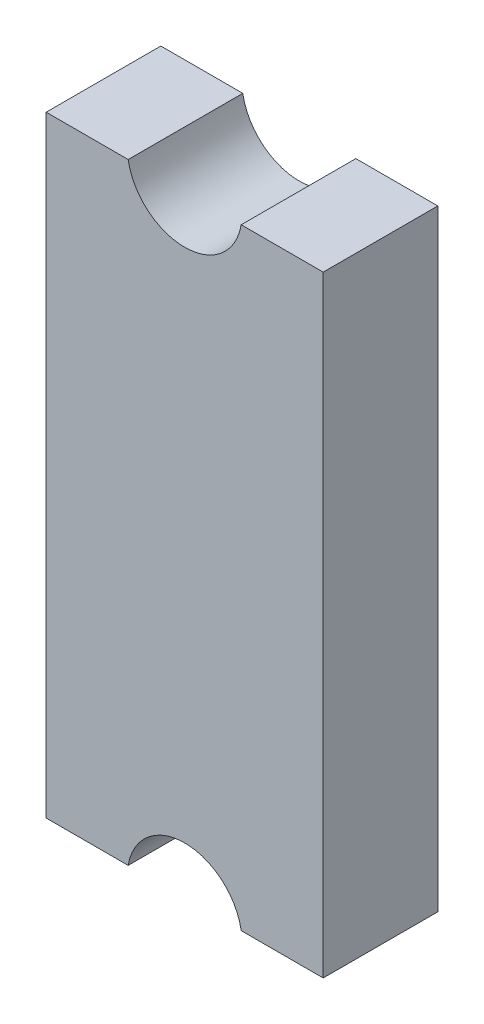
ISO-10303-21;
HEADER;
FILE_DESCRIPTION(('STEP AP214'),'2;1');
FILE_NAME('part.step','',(''),(''),'','','');
FILE_SCHEMA(('AUTOMOTIVE_DESIGN { 1 0 10303 214 1 1 1 1 }'));
ENDSEC;
DATA;
#1=APPLICATION_CONTEXT('core data for automotive mechanical design processes');
#2=APPLICATION_PROTOCOL_DEFINITION('international standard','automotive_design',2000,#1);
#3=PRODUCT_CONTEXT('',#1,'mechanical');
#4=PRODUCT('Part','Part','',(#3));
#5=PRODUCT_RELATED_PRODUCT_CATEGORY('part','',(#4));
#6=PRODUCT_DEFINITION_FORMATION('','',#4);
#7=PRODUCT_DEFINITION_CONTEXT('part definition',#1,'design');
#8=PRODUCT_DEFINITION('design','',#6,#7);
#9=PRODUCT_DEFINITION_SHAPE('','',#8);
#10=(LENGTH_UNIT() NAMED_UNIT(*) SI_UNIT(.MILLI.,.METRE.));
#11=(NAMED_UNIT(*) PLANE_ANGLE_UNIT() SI_UNIT($,.RADIAN.));
#12=(NAMED_UNIT(*) SI_UNIT($,.STERADIAN.) SOLID_ANGLE_UNIT());
#13=UNCERTAINTY_MEASURE_WITH_UNIT(LENGTH_MEASURE(1.E-05),#10,'distance_accuracy_value','');
#14=(GEOMETRIC_REPRESENTATION_CONTEXT(3) GLOBAL_UNCERTAINTY_ASSIGNED_CONTEXT((#13)) GLOBAL_UNIT_ASSIGNED_CONTEXT((#10,
#11,#12)) REPRESENTATION_CONTEXT('',''));
#15=CARTESIAN_POINT('',(0.,0.,0.));
#16=DIRECTION('',(0.,0.,1.));
#17=DIRECTION('',(1.,0.,0.));
#18=AXIS2_PLACEMENT_3D('',#15,#16,#17);
#19=CARTESIAN_POINT('',(-0.00534350019981917,-0.617441590055831,0.0297664210005663));
#20=DIRECTION('',(0.,0.,1.));
#21=DIRECTION('',(1.,0.,0.));
#22=AXIS2_PLACEMENT_3D('',#19,#20,#21);
#23=PLANE('',#22);
#24=CARTESIAN_POINT('',(-0.00534350019990265,0.207558409944186,0.0297664210005663));
#25=DIRECTION('',(0.,0.,1.));
#26=DIRECTION('',(-1.,0.,0.));
#27=AXIS2_PLACEMENT_3D('',#24,#25,#26);
#28=CIRCLE('',#27,0.150000000000034);
#29=CARTESIAN_POINT('',(-0.153245494777424,0.182558409944165,0.0297664210005663));
#30=VERTEX_POINT('',#29);
#31=CARTESIAN_POINT('',(0.142558494377624,0.182558409944195,0.0297664210005663));
#32=VERTEX_POINT('',#31);
#33=EDGE_CURVE('E11',#30,#32,#28,.T.);
#34=ORIENTED_EDGE('',*,*,#33,.T.);
#35=DIRECTION('',(-1.,-1.01196828694583E-13,0.));
#36=VECTOR('',#35,1.);
#37=CARTESIAN_POINT('',(0.357156499800111,0.182558409944217,0.0297664210005664));
#38=LINE('',#37,#36);
#39=CARTESIAN_POINT('',(0.357156499800111,0.182558409944217,0.0297664210005664));
#40=VERTEX_POINT('',#39);
#41=EDGE_CURVE('E24',#40,#32,#38,.T.);
#42=ORIENTED_EDGE('',*,*,#41,.F.);
#43=DIRECTION('',(-1.01196828694583E-13,1.,0.));
#44=VECTOR('',#43,1.);
#45=CARTESIAN_POINT('',(0.357156499800273,-1.41744159005578,0.0297664210005664));
#46=LINE('',#45,#44);
#47=CARTESIAN_POINT('',(0.357156499800273,-1.41744159005575,0.0297664210005663));
#48=VERTEX_POINT('',#47);
#49=EDGE_CURVE('E145',#48,#40,#46,.T.);
#50=ORIENTED_EDGE('',*,*,#49,.F.);
#51=DIRECTION('',(1.,1.01196828694583E-13,0.));
#52=VECTOR('',#51,1.);
#53=CARTESIAN_POINT('',(0.357156499800273,-1.41744159005575,0.0297664210005663));
#54=LINE('',#53,#52);
#55=CARTESIAN_POINT('',(0.142558494377786,-1.41744159005577,0.0297664210005663));
#56=VERTEX_POINT('',#55);
#57=EDGE_CURVE('E142',#56,#48,#54,.T.);
#58=ORIENTED_EDGE('',*,*,#57,.F.);
#59=CARTESIAN_POINT('',(-0.00534350019973568,-1.44244159005579,0.0297664210005663));
#60=DIRECTION('',(0.,0.,1.));
#61=DIRECTION('',(1.,0.,0.));
#62=AXIS2_PLACEMENT_3D('',#59,#60,#61);
#63=CIRCLE('',#62,0.150000000000034);
#64=CARTESIAN_POINT('',(-0.153245494777264,-1.41744159005581,0.0297664210005663));
#65=VERTEX_POINT('',#64);
#66=EDGE_CURVE('E140',#56,#65,#63,.T.);
#67=ORIENTED_EDGE('',*,*,#66,.T.);
#68=DIRECTION('',(1.,0.,0.));
#69=VECTOR('',#68,1.);
#70=CARTESIAN_POINT('',(-0.00534350019981917,-1.41744159005582,0.0297664210005663));
#71=LINE('',#70,#69);
#72=CARTESIAN_POINT('',(-0.367843500199804,-1.41744159005582,0.0297664210005663));
#73=VERTEX_POINT('',#72);
#74=EDGE_CURVE('E138',#73,#65,#71,.T.);
#75=ORIENTED_EDGE('',*,*,#74,.F.);
#76=DIRECTION('',(1.01196828694583E-13,-1.,0.));
#77=VECTOR('',#76,1.);
#78=CARTESIAN_POINT('',(-0.367843500199911,0.182558409944144,0.0297664210005664));
#79=LINE('',#78,#77);
#80=CARTESIAN_POINT('',(-0.367843500199911,0.182558409944144,0.0297664210005663));
#81=VERTEX_POINT('',#80);
#82=EDGE_CURVE('E93',#81,#73,#79,.T.);
#83=ORIENTED_EDGE('',*,*,#82,.F.);
#84=DIRECTION('',(-1.,-1.01196828694583E-13,0.));
#85=VECTOR('',#84,1.);
#86=CARTESIAN_POINT('',(0.357156499800111,0.182558409944217,0.0297664210005663));
#87=LINE('',#86,#85);
#88=EDGE_CURVE('E134',#30,#81,#87,.T.);
#89=ORIENTED_EDGE('',*,*,#88,.F.);
#90=EDGE_LOOP('',(#34,#42,#50,#58,#67,#75,#83,#89));
#91=FACE_BOUND('',#90,.T.);
#92=ADVANCED_FACE('F17',(#91),#23,.F.);
#93=CARTESIAN_POINT('',(-0.00534350019973568,-1.44244159005579,-0.221407354482631));
#94=DIRECTION('',(0.,0.,1.));
#95=DIRECTION('',(1.,0.,0.));
#96=AXIS2_PLACEMENT_3D('',#93,#94,#95);
#97=CYLINDRICAL_SURFACE('',#96,0.150000000000034);
#98=ORIENTED_EDGE('',*,*,#66,.F.);
#99=DIRECTION('',(0.,0.,-1.));
#100=VECTOR('',#99,1.);
#101=CARTESIAN_POINT('',(0.142558494377786,-1.41744159005577,0.0297664210005663));
#102=LINE('',#101,#100);
#103=CARTESIAN_POINT('',(0.142558494377786,-1.41744159005577,0.329766421000566));
#104=VERTEX_POINT('',#103);
#105=EDGE_CURVE('E131',#104,#56,#102,.T.);
#106=ORIENTED_EDGE('',*,*,#105,.F.);
#107=CARTESIAN_POINT('',(-0.00534350019973568,-1.44244159005579,0.329766421000566));
#108=DIRECTION('',(0.,0.,-1.));
#109=DIRECTION('',(1.,0.,0.));
#110=AXIS2_PLACEMENT_3D('',#107,#108,#109);
#111=CIRCLE('',#110,0.150000000000034);
#112=CARTESIAN_POINT('',(-0.153245494777264,-1.41744159005581,0.329766421000566));
#113=VERTEX_POINT('',#112);
#114=EDGE_CURVE('E129',#113,#104,#111,.T.);
#115=ORIENTED_EDGE('',*,*,#114,.F.);
#116=DIRECTION('',(0.,0.,1.));
#117=VECTOR('',#116,1.);
#118=CARTESIAN_POINT('',(-0.153245494777262,-1.4174415900558,0.0297664210005663));
#119=LINE('',#118,#117);
#120=EDGE_CURVE('E99',#65,#113,#119,.T.);
#121=ORIENTED_EDGE('',*,*,#120,.F.);
#122=EDGE_LOOP('',(#98,#106,#115,#121));
#123=FACE_BOUND('',#122,.T.);
#124=ADVANCED_FACE('F161',(#123),#97,.F.);
#125=CARTESIAN_POINT('',(0.357156499800273,-1.41744159005575,0.0297664210005663));
#126=DIRECTION('',(1.01196828694583E-13,-1.,0.));
#127=DIRECTION('',(1.,1.01196828694583E-13,0.));
#128=AXIS2_PLACEMENT_3D('',#125,#126,#127);
#129=PLANE('',#128);
#130=ORIENTED_EDGE('',*,*,#105,.T.);
#131=ORIENTED_EDGE('',*,*,#57,.T.);
#132=DIRECTION('',(0.,0.,-1.));
#133=VECTOR('',#132,1.);
#134=CARTESIAN_POINT('',(0.357156499800273,-1.41744159005575,0.0297664210005663));
#135=LINE('',#134,#133);
#136=CARTESIAN_POINT('',(0.357156499800273,-1.41744159005576,0.329766421000566));
#137=VERTEX_POINT('',#136);
#138=EDGE_CURVE('E125',#137,#48,#135,.T.);
#139=ORIENTED_EDGE('',*,*,#138,.F.);
#140=DIRECTION('',(1.,0.,0.));
#141=VECTOR('',#140,1.);
#142=CARTESIAN_POINT('',(-0.00534350019981917,-1.41744159005577,0.329766421000566));
#143=LINE('',#142,#141);
#144=EDGE_CURVE('E122',#104,#137,#143,.T.);
#145=ORIENTED_EDGE('',*,*,#144,.F.);
#146=EDGE_LOOP('',(#130,#131,#139,#145));
#147=FACE_BOUND('',#146,.T.);
#148=ADVANCED_FACE('F158',(#147),#129,.T.);
#149=CARTESIAN_POINT('',(0.357156499800273,-1.41744159005578,0.0297664210005663));
#150=DIRECTION('',(1.,1.01196828694583E-13,0.));
#151=DIRECTION('',(-1.01196828694583E-13,1.,0.));
#152=AXIS2_PLACEMENT_3D('',#149,#150,#151);
#153=PLANE('',#152);
#154=ORIENTED_EDGE('',*,*,#49,.T.);
#155=DIRECTION('',(0.,0.,-1.));
#156=VECTOR('',#155,1.);
#157=CARTESIAN_POINT('',(0.357156499800111,0.182558409944217,0.0297664210005663));
#158=LINE('',#157,#156);
#159=CARTESIAN_POINT('',(0.357156499800219,0.182558409944217,0.329766421000566));
#160=VERTEX_POINT('',#159);
#161=EDGE_CURVE('E119',#160,#40,#158,.T.);
#162=ORIENTED_EDGE('',*,*,#161,.F.);
#163=DIRECTION('',(0.,1.,0.));
#164=VECTOR('',#163,1.);
#165=CARTESIAN_POINT('',(0.357156499800273,-0.617441590055831,0.329766421000566));
#166=LINE('',#165,#164);
#167=EDGE_CURVE('E116',#137,#160,#166,.T.);
#168=ORIENTED_EDGE('',*,*,#167,.F.);
#169=ORIENTED_EDGE('',*,*,#138,.T.);
#170=EDGE_LOOP('',(#154,#162,#168,#169));
#171=FACE_BOUND('',#170,.T.);
#172=ADVANCED_FACE('F155',(#171),#153,.T.);
#173=CARTESIAN_POINT('',(0.357156499800111,0.182558409944217,0.0297664210005663));
#174=DIRECTION('',(-1.01196828694583E-13,1.,0.));
#175=DIRECTION('',(-1.,-1.01196828694583E-13,0.));
#176=AXIS2_PLACEMENT_3D('',#173,#174,#175);
#177=PLANE('',#176);
#178=DIRECTION('',(0.,0.,1.));
#179=VECTOR('',#178,1.);
#180=CARTESIAN_POINT('',(0.142558494377624,0.182558409944195,-0.221407354482631));
#181=LINE('',#180,#179);
#182=CARTESIAN_POINT('',(0.142558494377626,0.182558409944206,0.329766421000566));
#183=VERTEX_POINT('',#182);
#184=EDGE_CURVE('E114',#32,#183,#181,.T.);
#185=ORIENTED_EDGE('',*,*,#184,.T.);
#186=DIRECTION('',(-1.,0.,0.));
#187=VECTOR('',#186,1.);
#188=CARTESIAN_POINT('',(-0.00534350019981917,0.182558409944217,0.329766421000566));
#189=LINE('',#188,#187);
#190=EDGE_CURVE('E111',#160,#183,#189,.T.);
#191=ORIENTED_EDGE('',*,*,#190,.F.);
#192=ORIENTED_EDGE('',*,*,#161,.T.);
#193=ORIENTED_EDGE('',*,*,#41,.T.);
#194=EDGE_LOOP('',(#185,#191,#192,#193));
#195=FACE_BOUND('',#194,.T.);
#196=ADVANCED_FACE('F148',(#195),#177,.T.);
#197=CARTESIAN_POINT('',(-0.00534350019990265,0.207558409944186,-0.221407354482631));
#198=DIRECTION('',(0.,0.,-1.));
#199=DIRECTION('',(-1.,0.,0.));
#200=AXIS2_PLACEMENT_3D('',#197,#198,#199);
#201=CYLINDRICAL_SURFACE('',#200,0.150000000000034);
#202=DIRECTION('',(0.,0.,-1.));
#203=VECTOR('',#202,1.);
#204=CARTESIAN_POINT('',(-0.153245494777424,0.182558409944165,0.0297664210005663));
#205=LINE('',#204,#203);
#206=CARTESIAN_POINT('',(-0.153245494777424,0.182558409944165,0.329766421000566));
#207=VERTEX_POINT('',#206);
#208=EDGE_CURVE('E108',#207,#30,#205,.T.);
#209=ORIENTED_EDGE('',*,*,#208,.F.);
#210=CARTESIAN_POINT('',(-0.00534350019990265,0.207558409944186,0.329766421000566));
#211=DIRECTION('',(0.,0.,-1.));
#212=DIRECTION('',(-1.,0.,0.));
#213=AXIS2_PLACEMENT_3D('',#210,#211,#212);
#214=CIRCLE('',#213,0.150000000000034);
#215=EDGE_CURVE('E106',#183,#207,#214,.T.);
#216=ORIENTED_EDGE('',*,*,#215,.F.);
#217=ORIENTED_EDGE('',*,*,#184,.F.);
#218=ORIENTED_EDGE('',*,*,#33,.F.);
#219=EDGE_LOOP('',(#209,#216,#217,#218));
#220=FACE_BOUND('',#219,.T.);
#221=ADVANCED_FACE('F151',(#220),#201,.F.);
#222=CARTESIAN_POINT('',(0.357156499800111,0.182558409944217,0.0297664210005663));
#223=DIRECTION('',(-1.01196828694583E-13,1.,0.));
#224=DIRECTION('',(-1.,-1.01196828694583E-13,0.));
#225=AXIS2_PLACEMENT_3D('',#222,#223,#224);
#226=PLANE('',#225);
#227=ORIENTED_EDGE('',*,*,#208,.T.);
#228=ORIENTED_EDGE('',*,*,#88,.T.);
#229=DIRECTION('',(0.,0.,-1.));
#230=VECTOR('',#229,1.);
#231=CARTESIAN_POINT('',(-0.367843500199911,0.182558409944144,0.0297664210005663));
#232=LINE('',#231,#230);
#233=CARTESIAN_POINT('',(-0.367843500199911,0.182558409944158,0.329766421000566));
#234=VERTEX_POINT('',#233);
#235=EDGE_CURVE('E104',#234,#81,#232,.T.);
#236=ORIENTED_EDGE('',*,*,#235,.F.);
#237=DIRECTION('',(-1.,0.,0.));
#238=VECTOR('',#237,1.);
#239=CARTESIAN_POINT('',(-0.00534350019981917,0.182558409944165,0.329766421000566));
#240=LINE('',#239,#238);
#241=EDGE_CURVE('E85',#207,#234,#240,.T.);
#242=ORIENTED_EDGE('',*,*,#241,.F.);
#243=EDGE_LOOP('',(#227,#228,#236,#242));
#244=FACE_BOUND('',#243,.T.);
#245=ADVANCED_FACE('F163',(#244),#226,.T.);
#246=CARTESIAN_POINT('',(-0.367843500199911,0.182558409944144,0.0297664210005663));
#247=DIRECTION('',(-1.,-1.01196828694583E-13,0.));
#248=DIRECTION('',(1.01196828694583E-13,-1.,0.));
#249=AXIS2_PLACEMENT_3D('',#246,#247,#248);
#250=PLANE('',#249);
#251=DIRECTION('',(0.,-1.,0.));
#252=VECTOR('',#251,1.);
#253=CARTESIAN_POINT('',(-0.367843500199911,-0.617441590055831,0.329766421000566));
#254=LINE('',#253,#252);
#255=CARTESIAN_POINT('',(-0.367843500199857,-1.41744159005582,0.329766421000566));
#256=VERTEX_POINT('',#255);
#257=EDGE_CURVE('E79',#234,#256,#254,.T.);
#258=ORIENTED_EDGE('',*,*,#257,.F.);
#259=ORIENTED_EDGE('',*,*,#235,.T.);
#260=ORIENTED_EDGE('',*,*,#82,.T.);
#261=DIRECTION('',(0.,0.,-1.));
#262=VECTOR('',#261,1.);
#263=CARTESIAN_POINT('',(-0.367843500199749,-1.41744159005582,0.0297664210005663));
#264=LINE('',#263,#262);
#265=EDGE_CURVE('E88',#256,#73,#264,.T.);
#266=ORIENTED_EDGE('',*,*,#265,.F.);
#267=EDGE_LOOP('',(#258,#259,#260,#266));
#268=FACE_BOUND('',#267,.T.);
#269=ADVANCED_FACE('F92',(#268),#250,.T.);
#270=CARTESIAN_POINT('',(0.357156499800273,-1.41744159005575,0.0297664210005663));
#271=DIRECTION('',(1.01196828694583E-13,-1.,0.));
#272=DIRECTION('',(1.,1.01196828694583E-13,0.));
#273=AXIS2_PLACEMENT_3D('',#270,#271,#272);
#274=PLANE('',#273);
#275=ORIENTED_EDGE('',*,*,#120,.T.);
#276=DIRECTION('',(1.,0.,0.));
#277=VECTOR('',#276,1.);
#278=CARTESIAN_POINT('',(-0.00534350019981917,-1.41744159005582,0.329766421000566));
#279=LINE('',#278,#277);
#280=EDGE_CURVE('E83',#256,#113,#279,.T.);
#281=ORIENTED_EDGE('',*,*,#280,.F.);
#282=ORIENTED_EDGE('',*,*,#265,.T.);
#283=ORIENTED_EDGE('',*,*,#74,.T.);
#284=EDGE_LOOP('',(#275,#281,#282,#283));
#285=FACE_BOUND('',#284,.T.);
#286=ADVANCED_FACE('F97',(#285),#274,.T.);
#287=CARTESIAN_POINT('',(-0.00534350019981917,-0.617441590055831,0.329766421000566));
#288=DIRECTION('',(0.,0.,1.));
#289=DIRECTION('',(1.,0.,0.));
#290=AXIS2_PLACEMENT_3D('',#287,#288,#289);
#291=PLANE('',#290);
#292=ORIENTED_EDGE('',*,*,#257,.T.);
#293=ORIENTED_EDGE('',*,*,#280,.T.);
#294=ORIENTED_EDGE('',*,*,#114,.T.);
#295=ORIENTED_EDGE('',*,*,#144,.T.);
#296=ORIENTED_EDGE('',*,*,#167,.T.);
#297=ORIENTED_EDGE('',*,*,#190,.T.);
#298=ORIENTED_EDGE('',*,*,#215,.T.);
#299=ORIENTED_EDGE('',*,*,#241,.T.);
#300=EDGE_LOOP('',(#292,#293,#294,#295,#296,#297,#298,#299));
#301=FACE_BOUND('',#300,.T.);
#302=ADVANCED_FACE('F81',(#301),#291,.T.);
#303=CLOSED_SHELL('',(#92,#124,#148,#172,#196,#221,#245,#269,#286,#302));
#304=MANIFOLD_SOLID_BREP('B1',#303);
#305=ADVANCED_BREP_SHAPE_REPRESENTATION('',(#18,#304),#14);
#306=SHAPE_DEFINITION_REPRESENTATION(#9,#305);
ENDSEC;
END-ISO-10303-21;
